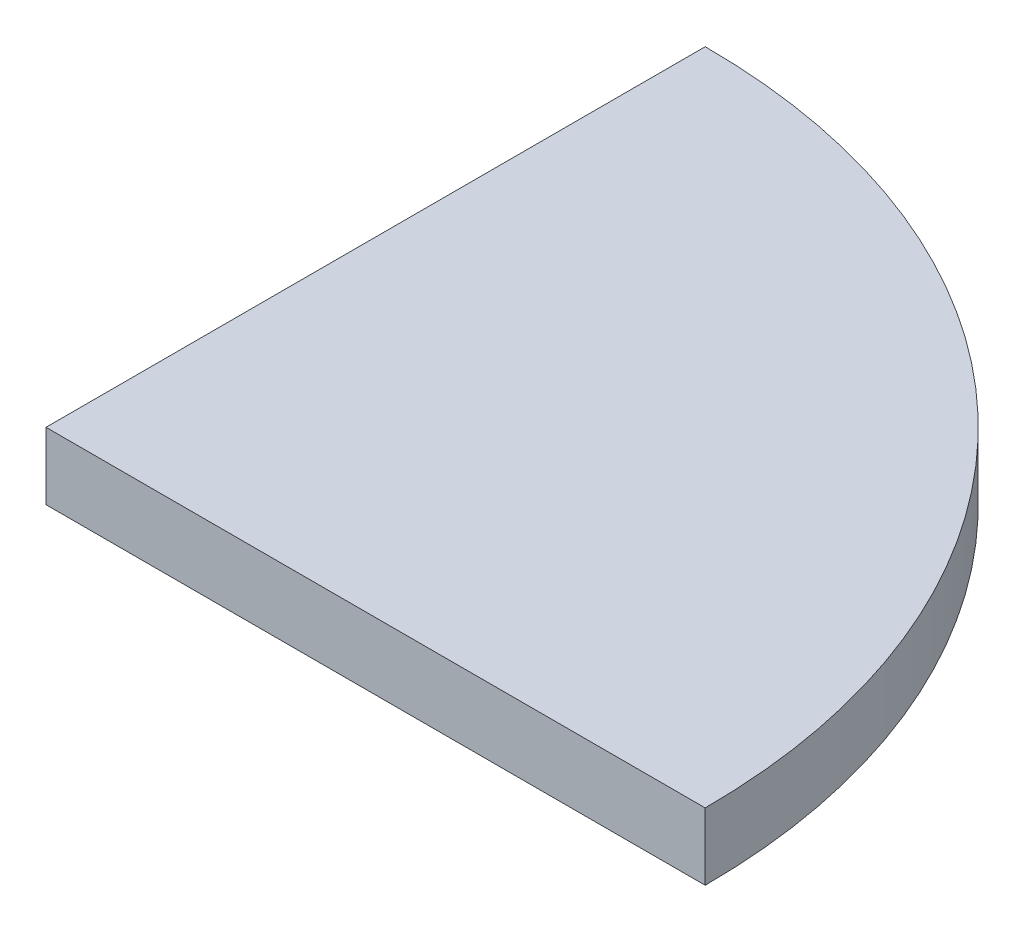
ISO-10303-21;
HEADER;
FILE_DESCRIPTION(('STEP AP214'),'2;1');
FILE_NAME('part.step','',(''),(''),'','','');
FILE_SCHEMA(('AUTOMOTIVE_DESIGN { 1 0 10303 214 1 1 1 1 }'));
ENDSEC;
DATA;
#1=APPLICATION_CONTEXT('core data for automotive mechanical design processes');
#2=APPLICATION_PROTOCOL_DEFINITION('international standard','automotive_design',2000,#1);
#3=PRODUCT_CONTEXT('',#1,'mechanical');
#4=PRODUCT('Part','Part','',(#3));
#5=PRODUCT_RELATED_PRODUCT_CATEGORY('part','',(#4));
#6=PRODUCT_DEFINITION_FORMATION('','',#4);
#7=PRODUCT_DEFINITION_CONTEXT('part definition',#1,'design');
#8=PRODUCT_DEFINITION('design','',#6,#7);
#9=PRODUCT_DEFINITION_SHAPE('','',#8);
#10=(LENGTH_UNIT() NAMED_UNIT(*) SI_UNIT(.MILLI.,.METRE.));
#11=(NAMED_UNIT(*) PLANE_ANGLE_UNIT() SI_UNIT($,.RADIAN.));
#12=(NAMED_UNIT(*) SI_UNIT($,.STERADIAN.) SOLID_ANGLE_UNIT());
#13=UNCERTAINTY_MEASURE_WITH_UNIT(LENGTH_MEASURE(1.E-05),#10,'distance_accuracy_value','');
#14=(GEOMETRIC_REPRESENTATION_CONTEXT(3) GLOBAL_UNCERTAINTY_ASSIGNED_CONTEXT((#13)) GLOBAL_UNIT_ASSIGNED_CONTEXT((#10,
#11,#12)) REPRESENTATION_CONTEXT('',''));
#15=CARTESIAN_POINT('',(0.,0.,0.));
#16=DIRECTION('',(0.,0.,1.));
#17=DIRECTION('',(1.,0.,0.));
#18=AXIS2_PLACEMENT_3D('',#15,#16,#17);
#19=CARTESIAN_POINT('',(0.,1.5,-14.75));
#20=DIRECTION('',(1.,0.,0.));
#21=DIRECTION('',(0.,0.,-1.));
#22=AXIS2_PLACEMENT_3D('',#19,#20,#21);
#23=PLANE('',#22);
#24=DIRECTION('',(0.,0.,1.));
#25=VECTOR('',#24,1.);
#26=CARTESIAN_POINT('',(0.,0.,-14.75));
#27=LINE('',#26,#25);
#28=CARTESIAN_POINT('',(0.,0.,-14.75));
#29=VERTEX_POINT('',#28);
#30=CARTESIAN_POINT('',(0.,0.,0.));
#31=VERTEX_POINT('',#30);
#32=EDGE_CURVE('E80',#29,#31,#27,.T.);
#33=ORIENTED_EDGE('',*,*,#32,.T.);
#34=DIRECTION('',(0.,-1.,0.));
#35=VECTOR('',#34,1.);
#36=CARTESIAN_POINT('',(0.,1.5,0.));
#37=LINE('',#36,#35);
#38=CARTESIAN_POINT('',(0.,1.5,0.));
#39=VERTEX_POINT('',#38);
#40=EDGE_CURVE('E11',#39,#31,#37,.T.);
#41=ORIENTED_EDGE('',*,*,#40,.F.);
#42=DIRECTION('',(0.,0.,1.));
#43=VECTOR('',#42,1.);
#44=CARTESIAN_POINT('',(0.,1.5,-14.75));
#45=LINE('',#44,#43);
#46=CARTESIAN_POINT('',(0.,1.5,-14.75));
#47=VERTEX_POINT('',#46);
#48=EDGE_CURVE('E73',#47,#39,#45,.T.);
#49=ORIENTED_EDGE('',*,*,#48,.F.);
#50=DIRECTION('',(0.,-1.,0.));
#51=VECTOR('',#50,1.);
#52=CARTESIAN_POINT('',(0.,1.5,-14.75));
#53=LINE('',#52,#51);
#54=EDGE_CURVE('E81',#47,#29,#53,.T.);
#55=ORIENTED_EDGE('',*,*,#54,.T.);
#56=EDGE_LOOP('',(#33,#41,#49,#55));
#57=FACE_BOUND('',#56,.T.);
#58=ADVANCED_FACE('F33',(#57),#23,.F.);
#59=CARTESIAN_POINT('',(0.,1.5,0.));
#60=DIRECTION('',(0.,0.,-1.));
#61=DIRECTION('',(-1.,0.,0.));
#62=AXIS2_PLACEMENT_3D('',#59,#60,#61);
#63=PLANE('',#62);
#64=DIRECTION('',(1.,0.,0.));
#65=VECTOR('',#64,1.);
#66=CARTESIAN_POINT('',(0.,0.,0.));
#67=LINE('',#66,#65);
#68=CARTESIAN_POINT('',(14.75,0.,0.));
#69=VERTEX_POINT('',#68);
#70=EDGE_CURVE('E61',#31,#69,#67,.T.);
#71=ORIENTED_EDGE('',*,*,#70,.T.);
#72=DIRECTION('',(0.,-1.,0.));
#73=VECTOR('',#72,1.);
#74=CARTESIAN_POINT('',(14.75,1.5,0.));
#75=LINE('',#74,#73);
#76=CARTESIAN_POINT('',(14.75,1.5,0.));
#77=VERTEX_POINT('',#76);
#78=EDGE_CURVE('E41',#77,#69,#75,.T.);
#79=ORIENTED_EDGE('',*,*,#78,.F.);
#80=DIRECTION('',(1.,0.,0.));
#81=VECTOR('',#80,1.);
#82=CARTESIAN_POINT('',(0.,1.5,0.));
#83=LINE('',#82,#81);
#84=EDGE_CURVE('E69',#39,#77,#83,.T.);
#85=ORIENTED_EDGE('',*,*,#84,.F.);
#86=ORIENTED_EDGE('',*,*,#40,.T.);
#87=EDGE_LOOP('',(#71,#79,#85,#86));
#88=FACE_BOUND('',#87,.T.);
#89=ADVANCED_FACE('F70',(#88),#63,.F.);
#90=CARTESIAN_POINT('',(0.,1.5,0.));
#91=DIRECTION('',(0.,-1.,0.));
#92=DIRECTION('',(0.,0.,-1.));
#93=AXIS2_PLACEMENT_3D('',#90,#91,#92);
#94=CYLINDRICAL_SURFACE('',#93,14.75);
#95=CARTESIAN_POINT('',(0.,0.,0.));
#96=DIRECTION('',(0.,1.,0.));
#97=DIRECTION('',(0.,0.,1.));
#98=AXIS2_PLACEMENT_3D('',#95,#96,#97);
#99=CIRCLE('',#98,14.75);
#100=EDGE_CURVE('E66',#69,#29,#99,.T.);
#101=ORIENTED_EDGE('',*,*,#100,.T.);
#102=ORIENTED_EDGE('',*,*,#54,.F.);
#103=CARTESIAN_POINT('',(0.,1.5,0.));
#104=DIRECTION('',(0.,1.,0.));
#105=DIRECTION('',(0.,0.,1.));
#106=AXIS2_PLACEMENT_3D('',#103,#104,#105);
#107=CIRCLE('',#106,14.75);
#108=EDGE_CURVE('E49',#77,#47,#107,.T.);
#109=ORIENTED_EDGE('',*,*,#108,.F.);
#110=ORIENTED_EDGE('',*,*,#78,.T.);
#111=EDGE_LOOP('',(#101,#102,#109,#110));
#112=FACE_BOUND('',#111,.T.);
#113=ADVANCED_FACE('F88',(#112),#94,.T.);
#114=CARTESIAN_POINT('',(0.,1.5,0.));
#115=DIRECTION('',(0.,1.,0.));
#116=DIRECTION('',(0.,0.,1.));
#117=AXIS2_PLACEMENT_3D('',#114,#115,#116);
#118=PLANE('',#117);
#119=ORIENTED_EDGE('',*,*,#48,.T.);
#120=ORIENTED_EDGE('',*,*,#84,.T.);
#121=ORIENTED_EDGE('',*,*,#108,.T.);
#122=EDGE_LOOP('',(#119,#120,#121));
#123=FACE_BOUND('',#122,.T.);
#124=ADVANCED_FACE('F76',(#123),#118,.T.);
#125=CARTESIAN_POINT('',(0.,0.,0.));
#126=DIRECTION('',(0.,1.,0.));
#127=DIRECTION('',(0.,0.,1.));
#128=AXIS2_PLACEMENT_3D('',#125,#126,#127);
#129=PLANE('',#128);
#130=ORIENTED_EDGE('',*,*,#32,.F.);
#131=ORIENTED_EDGE('',*,*,#100,.F.);
#132=ORIENTED_EDGE('',*,*,#70,.F.);
#133=EDGE_LOOP('',(#130,#131,#132));
#134=FACE_BOUND('',#133,.T.);
#135=ADVANCED_FACE('F89',(#134),#129,.F.);
#136=CLOSED_SHELL('',(#58,#89,#113,#124,#135));
#137=MANIFOLD_SOLID_BREP('B2',#136);
#138=ADVANCED_BREP_SHAPE_REPRESENTATION('',(#18,#137),#14);
#139=SHAPE_DEFINITION_REPRESENTATION(#9,#138);
ENDSEC;
END-ISO-10303-21;
